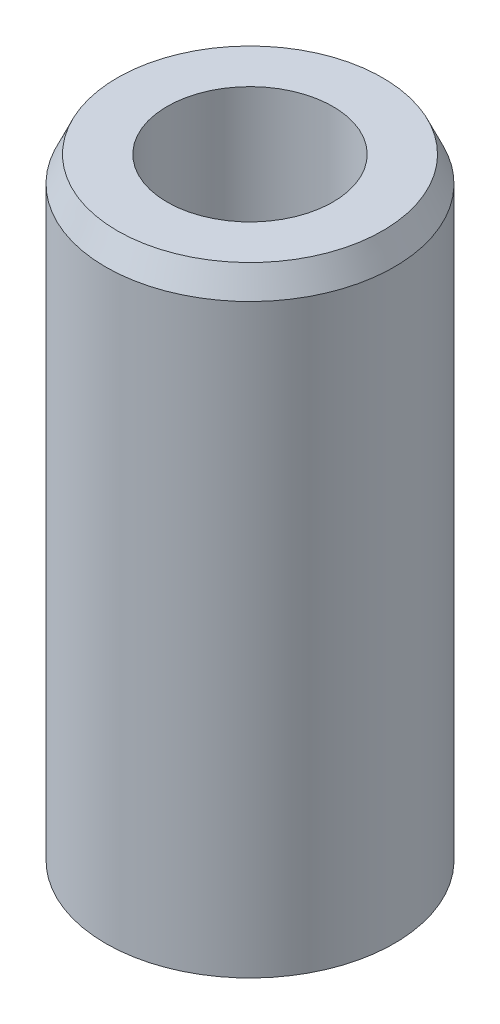
ISO-10303-21;
HEADER;
FILE_DESCRIPTION(('STEP AP214'),'2;1');
FILE_NAME('part.step','',(''),(''),'','','');
FILE_SCHEMA(('AUTOMOTIVE_DESIGN { 1 0 10303 214 1 1 1 1 }'));
ENDSEC;
DATA;
#1=APPLICATION_CONTEXT('core data for automotive mechanical design processes');
#2=APPLICATION_PROTOCOL_DEFINITION('international standard','automotive_design',2000,#1);
#3=PRODUCT_CONTEXT('',#1,'mechanical');
#4=PRODUCT('Part','Part','',(#3));
#5=PRODUCT_RELATED_PRODUCT_CATEGORY('part','',(#4));
#6=PRODUCT_DEFINITION_FORMATION('','',#4);
#7=PRODUCT_DEFINITION_CONTEXT('part definition',#1,'design');
#8=PRODUCT_DEFINITION('design','',#6,#7);
#9=PRODUCT_DEFINITION_SHAPE('','',#8);
#10=(LENGTH_UNIT() NAMED_UNIT(*) SI_UNIT(.MILLI.,.METRE.));
#11=(NAMED_UNIT(*) PLANE_ANGLE_UNIT() SI_UNIT($,.RADIAN.));
#12=(NAMED_UNIT(*) SI_UNIT($,.STERADIAN.) SOLID_ANGLE_UNIT());
#13=UNCERTAINTY_MEASURE_WITH_UNIT(LENGTH_MEASURE(1.E-05),#10,'distance_accuracy_value','');
#14=(GEOMETRIC_REPRESENTATION_CONTEXT(3) GLOBAL_UNCERTAINTY_ASSIGNED_CONTEXT((#13)) GLOBAL_UNIT_ASSIGNED_CONTEXT((#10,
#11,#12)) REPRESENTATION_CONTEXT('',''));
#15=CARTESIAN_POINT('',(0.,0.,0.));
#16=DIRECTION('',(0.,0.,1.));
#17=DIRECTION('',(1.,0.,0.));
#18=AXIS2_PLACEMENT_3D('',#15,#16,#17);
#19=CARTESIAN_POINT('',(0.,64.7807799880717,0.));
#20=DIRECTION('',(0.,-1.,0.));
#21=DIRECTION('',(0.,0.,-1.));
#22=AXIS2_PLACEMENT_3D('',#19,#20,#21);
#23=CYLINDRICAL_SURFACE('',#22,15.);
#24=CARTESIAN_POINT('',(0.,62.1252023368706,0.));
#25=DIRECTION('',(0.,1.,0.));
#26=DIRECTION('',(0.,0.,1.));
#27=AXIS2_PLACEMENT_3D('',#24,#25,#26);
#28=CIRCLE('',#27,15.);
#29=CARTESIAN_POINT('',(0.,62.1252023368706,15.));
#30=VERTEX_POINT('',#29);
#31=EDGE_CURVE('E50',#30,#30,#28,.F.);
#32=ORIENTED_EDGE('',*,*,#31,.T.);
#33=EDGE_LOOP('',(#32));
#34=FACE_BOUND('',#33,.T.);
#35=CARTESIAN_POINT('',(0.,1.21092379874657,0.));
#36=DIRECTION('',(0.,1.,0.));
#37=DIRECTION('',(0.,0.,1.));
#38=AXIS2_PLACEMENT_3D('',#35,#36,#37);
#39=CIRCLE('',#38,15.);
#40=CARTESIAN_POINT('',(0.,1.21092379874657,15.));
#41=VERTEX_POINT('',#40);
#42=EDGE_CURVE('E51',#41,#41,#39,.T.);
#43=ORIENTED_EDGE('',*,*,#42,.T.);
#44=EDGE_LOOP('',(#43));
#45=FACE_BOUND('',#44,.T.);
#46=ADVANCED_FACE('F39',(#34,#45),#23,.T.);
#47=CARTESIAN_POINT('',(0.,64.7807799880717,0.));
#48=DIRECTION('',(0.,1.,0.));
#49=DIRECTION('',(0.,0.,1.));
#50=AXIS2_PLACEMENT_3D('',#47,#48,#49);
#51=PLANE('',#50);
#52=CARTESIAN_POINT('',(0.,64.7807799880717,0.));
#53=DIRECTION('',(0.,1.,0.));
#54=DIRECTION('',(0.,0.,1.));
#55=AXIS2_PLACEMENT_3D('',#52,#53,#54);
#56=CIRCLE('',#55,13.7890762012534);
#57=CARTESIAN_POINT('',(0.,64.7807799880717,13.7890762012534));
#58=VERTEX_POINT('',#57);
#59=EDGE_CURVE('E54',#58,#58,#56,.T.);
#60=ORIENTED_EDGE('',*,*,#59,.T.);
#61=EDGE_LOOP('',(#60));
#62=FACE_BOUND('',#61,.T.);
#63=CARTESIAN_POINT('',(0.,64.7807799880717,0.));
#64=DIRECTION('',(0.,1.,0.));
#65=DIRECTION('',(0.,0.,1.));
#66=AXIS2_PLACEMENT_3D('',#63,#64,#65);
#67=CIRCLE('',#66,8.61869740344722);
#68=CARTESIAN_POINT('',(0.,64.7807799880717,8.61869740344722));
#69=VERTEX_POINT('',#68);
#70=EDGE_CURVE('E58',#69,#69,#67,.T.);
#71=ORIENTED_EDGE('',*,*,#70,.F.);
#72=EDGE_LOOP('',(#71));
#73=FACE_BOUND('',#72,.T.);
#74=ADVANCED_FACE('F69',(#62,#73),#51,.T.);
#75=CARTESIAN_POINT('',(0.,0.,0.));
#76=DIRECTION('',(0.,1.,0.));
#77=DIRECTION('',(0.,0.,1.));
#78=AXIS2_PLACEMENT_3D('',#75,#76,#77);
#79=PLANE('',#78);
#80=CARTESIAN_POINT('',(0.,0.,0.));
#81=DIRECTION('',(0.,1.,0.));
#82=DIRECTION('',(0.,0.,1.));
#83=AXIS2_PLACEMENT_3D('',#80,#81,#82);
#84=CIRCLE('',#83,12.3444223487988);
#85=CARTESIAN_POINT('',(0.,0.,12.3444223487988));
#86=VERTEX_POINT('',#85);
#87=EDGE_CURVE('E10',#86,#86,#84,.F.);
#88=ORIENTED_EDGE('',*,*,#87,.T.);
#89=EDGE_LOOP('',(#88));
#90=FACE_BOUND('',#89,.T.);
#91=CARTESIAN_POINT('',(0.,0.,0.));
#92=DIRECTION('',(0.,1.,0.));
#93=DIRECTION('',(0.,0.,1.));
#94=AXIS2_PLACEMENT_3D('',#91,#92,#93);
#95=CIRCLE('',#94,8.61869740344722);
#96=CARTESIAN_POINT('',(0.,0.,8.61869740344722));
#97=VERTEX_POINT('',#96);
#98=EDGE_CURVE('E63',#97,#97,#95,.T.);
#99=ORIENTED_EDGE('',*,*,#98,.T.);
#100=EDGE_LOOP('',(#99));
#101=FACE_BOUND('',#100,.T.);
#102=ADVANCED_FACE('F75',(#90,#101),#79,.F.);
#103=CARTESIAN_POINT('',(0.,64.7807799880717,0.));
#104=DIRECTION('',(0.,-1.,0.));
#105=DIRECTION('',(0.,0.,-1.));
#106=AXIS2_PLACEMENT_3D('',#103,#104,#105);
#107=CYLINDRICAL_SURFACE('',#106,8.61869740344722);
#108=ORIENTED_EDGE('',*,*,#70,.T.);
#109=EDGE_LOOP('',(#108));
#110=FACE_BOUND('',#109,.T.);
#111=ORIENTED_EDGE('',*,*,#98,.F.);
#112=EDGE_LOOP('',(#111));
#113=FACE_BOUND('',#112,.T.);
#114=ADVANCED_FACE('F70',(#110,#113),#107,.F.);
#115=CARTESIAN_POINT('',(0.,64.7807799880717,0.));
#116=DIRECTION('',(0.,-1.,0.));
#117=DIRECTION('',(0.,0.,-1.));
#118=AXIS2_PLACEMENT_3D('',#115,#116,#117);
#119=CONICAL_SURFACE('',#118,13.7890762012534,0.427826198455966);
#120=ORIENTED_EDGE('',*,*,#31,.F.);
#121=EDGE_LOOP('',(#120));
#122=FACE_BOUND('',#121,.T.);
#123=ORIENTED_EDGE('',*,*,#59,.F.);
#124=EDGE_LOOP('',(#123));
#125=FACE_BOUND('',#124,.T.);
#126=ADVANCED_FACE('F81',(#122,#125),#119,.T.);
#127=CARTESIAN_POINT('',(0.,1.21092379874657,0.));
#128=DIRECTION('',(0.,1.,0.));
#129=DIRECTION('',(0.,0.,1.));
#130=AXIS2_PLACEMENT_3D('',#127,#128,#129);
#131=CONICAL_SURFACE('',#130,15.,1.14297012833893);
#132=CARTESIAN_POINT('',(0.,0.,12.3444223487988));
#133=CARTESIAN_POINT('',(0.,0.0126137895702765,12.3720846159988));
#134=CARTESIAN_POINT('',(0.,0.0252275791405533,12.3997468831988));
#135=CARTESIAN_POINT('',(0.,0.050455158281107,12.4550714175988));
#136=CARTESIAN_POINT('',(0.,0.0630689478513838,12.4827336847989));
#137=CARTESIAN_POINT('',(0.,0.0882965269919373,12.5380582191989));
#138=CARTESIAN_POINT('',(0.,0.100910316562214,12.5657204863989));
#139=CARTESIAN_POINT('',(0.,0.126137895702768,12.6210450207989));
#140=CARTESIAN_POINT('',(0.,0.138751685273045,12.6487072879989));
#141=CARTESIAN_POINT('',(0.,0.163979264413598,12.704031822399));
#142=CARTESIAN_POINT('',(0.,0.176593053983875,12.731694089599));
#143=CARTESIAN_POINT('',(0.,0.201820633124428,12.787018623999));
#144=CARTESIAN_POINT('',(0.,0.214434422694705,12.814680891199));
#145=CARTESIAN_POINT('',(0.,0.239662001835259,12.870005425599));
#146=CARTESIAN_POINT('',(0.,0.252275791405536,12.897667692799));
#147=CARTESIAN_POINT('',(0.,0.277503370546089,12.9529922271991));
#148=CARTESIAN_POINT('',(0.,0.290117160116366,12.9806544943991));
#149=CARTESIAN_POINT('',(0.,0.315344739256919,13.0359790287991));
#150=CARTESIAN_POINT('',(0.,0.327958528827196,13.0636412959991));
#151=CARTESIAN_POINT('',(0.,0.35318610796775,13.1189658303991));
#152=CARTESIAN_POINT('',(0.,0.365799897538027,13.1466280975992));
#153=CARTESIAN_POINT('',(0.,0.39102747667858,13.2019526319992));
#154=CARTESIAN_POINT('',(0.,0.403641266248857,13.2296148991992));
#155=CARTESIAN_POINT('',(0.,0.428868845389411,13.2849394335992));
#156=CARTESIAN_POINT('',(0.,0.441482634959687,13.3126017007992));
#157=CARTESIAN_POINT('',(0.,0.466710214100241,13.3679262351993));
#158=CARTESIAN_POINT('',(0.,0.479324003670518,13.3955885023993));
#159=CARTESIAN_POINT('',(0.,0.504551582811071,13.4509130367993));
#160=CARTESIAN_POINT('',(0.,0.517165372381348,13.4785753039993));
#161=CARTESIAN_POINT('',(0.,0.542392951521902,13.5338998383993));
#162=CARTESIAN_POINT('',(0.,0.555006741092179,13.5615621055993));
#163=CARTESIAN_POINT('',(0.,0.580234320232732,13.6168866399994));
#164=CARTESIAN_POINT('',(0.,0.592848109803009,13.6445489071994));
#165=CARTESIAN_POINT('',(0.,0.618075688943562,13.6998734415994));
#166=CARTESIAN_POINT('',(0.,0.630689478513839,13.7275357087994));
#167=CARTESIAN_POINT('',(0.,0.655917057654393,13.7828602431994));
#168=CARTESIAN_POINT('',(0.,0.66853084722467,13.8105225103995));
#169=CARTESIAN_POINT('',(0.,0.693758426365223,13.8658470447995));
#170=CARTESIAN_POINT('',(0.,0.7063722159355,13.8935093119995));
#171=CARTESIAN_POINT('',(0.,0.731599795076053,13.9488338463995));
#172=CARTESIAN_POINT('',(0.,0.74421358464633,13.9764961135995));
#173=CARTESIAN_POINT('',(0.,0.769441163786884,14.0318206479996));
#174=CARTESIAN_POINT('',(0.,0.782054953357161,14.0594829151996));
#175=CARTESIAN_POINT('',(0.,0.807282532497714,14.1148074495996));
#176=CARTESIAN_POINT('',(0.,0.819896322067991,14.1424697167996));
#177=CARTESIAN_POINT('',(0.,0.845123901208545,14.1977942511996));
#178=CARTESIAN_POINT('',(0.,0.857737690778822,14.2254565183996));
#179=CARTESIAN_POINT('',(0.,0.882965269919375,14.2807810527997));
#180=CARTESIAN_POINT('',(0.,0.895579059489652,14.3084433199997));
#181=CARTESIAN_POINT('',(0.,0.920806638630206,14.3637678543997));
#182=CARTESIAN_POINT('',(0.,0.933420428200482,14.3914301215997));
#183=CARTESIAN_POINT('',(0.,0.958648007341036,14.4467546559997));
#184=CARTESIAN_POINT('',(0.,0.971261796911312,14.4744169231998));
#185=CARTESIAN_POINT('',(0.,0.996489376051866,14.5297414575998));
#186=CARTESIAN_POINT('',(0.,1.00910316562214,14.5574037247998));
#187=CARTESIAN_POINT('',(0.,1.0343307447627,14.6127282591998));
#188=CARTESIAN_POINT('',(0.,1.04694453433297,14.6403905263998));
#189=CARTESIAN_POINT('',(0.,1.07217211347353,14.6957150607999));
#190=CARTESIAN_POINT('',(0.,1.0847859030438,14.7233773279999));
#191=CARTESIAN_POINT('',(0.,1.11001348218436,14.7787018623999));
#192=CARTESIAN_POINT('',(0.,1.12262727175463,14.8063641295999));
#193=CARTESIAN_POINT('',(0.,1.14785485089519,14.8616886639999));
#194=CARTESIAN_POINT('',(0.,1.16046864046546,14.8893509311999));
#195=CARTESIAN_POINT('',(0.,1.18569621960602,14.9446754656));
#196=CARTESIAN_POINT('',(0.,1.19831000917629,14.9723377328));
#197=CARTESIAN_POINT('',(0.,1.21092379874657,15.));
#198=B_SPLINE_CURVE_WITH_KNOTS('',3,(#132,#133,#134,#135,#136,#137,#138,#139,#140,#141,#142,
#143,#144,#145,#146,#147,#148,#149,#150,#151,#152,#153,#154,#155,#156,#157,#158,#159,#160,#161,
#162,#163,#164,#165,#166,#167,#168,#169,#170,#171,#172,#173,#174,#175,#176,#177,#178,#179,#180,
#181,#182,#183,#184,#185,#186,#187,#188,#189,#190,#191,#192,#193,#194,#195,#196,#197),
.UNSPECIFIED.,.F.,.F.,(4,2,2,2,2,2,2,2,2,2,2,2,2,2,2,2,2,2,2,2,2,2,2,2,2,2,2,2,2,2,2,2,4),(0.,
0.0912073375650946,0.182414675130189,0.273622012695284,0.364829350260377,0.456036687825472,
0.547244025390566,0.638451362955661,0.729658700520756,0.820866038085849,0.912073375650943,
1.00328071321604,1.09448805078113,1.18569538834623,1.27690272591132,1.36811006347641,
1.45931740104151,1.5505247386066,1.6417320761717,1.73293941373679,1.82414675130189,
1.91535408886698,2.00656142643207,2.09776876399717,2.18897610156226,2.28018343912736,
2.37139077669245,2.46259811425755,2.55380545182264,2.64501278938773,2.73622012695283,
2.82742746451792,2.91863480208302),.UNSPECIFIED.);
#199=EDGE_CURVE('BSEAM45',#86,#41,#198,.T.);
#200=ORIENTED_EDGE('',*,*,#87,.F.);
#201=ORIENTED_EDGE('',*,*,#42,.F.);
#202=ORIENTED_EDGE('',*,*,#199,.T.);
#203=ORIENTED_EDGE('',*,*,#199,.F.);
#204=EDGE_LOOP('',(#200,#202,#201,#203));
#205=FACE_BOUND('',#204,.T.);
#206=ADVANCED_FACE('F45',(#205),#131,.T.);
#207=CLOSED_SHELL('',(#46,#74,#102,#114,#126,#206));
#208=MANIFOLD_SOLID_BREP('B2',#207);
#209=ADVANCED_BREP_SHAPE_REPRESENTATION('',(#18,#208),#14);
#210=SHAPE_DEFINITION_REPRESENTATION(#9,#209);
ENDSEC;
END-ISO-10303-21;
